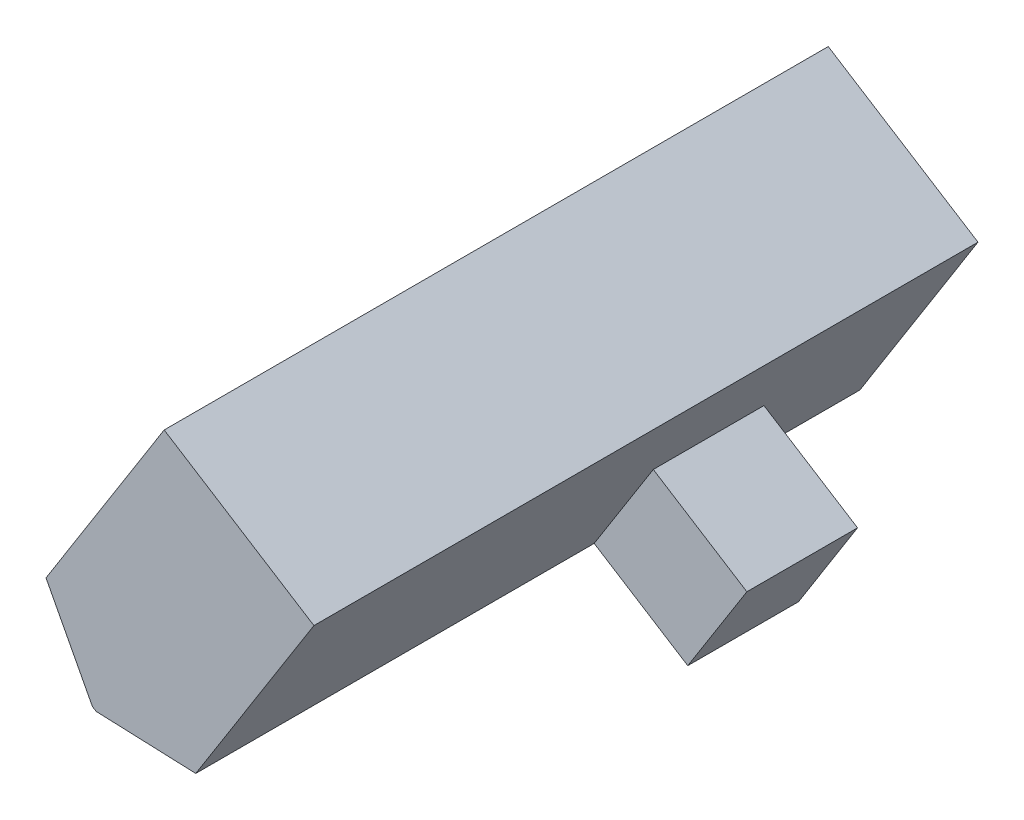
ISO-10303-21;
HEADER;
FILE_DESCRIPTION(('STEP AP214'),'2;1');
FILE_NAME('part.step','',(''),(''),'','','');
FILE_SCHEMA(('AUTOMOTIVE_DESIGN { 1 0 10303 214 1 1 1 1 }'));
ENDSEC;
DATA;
#1=APPLICATION_CONTEXT('core data for automotive mechanical design processes');
#2=APPLICATION_PROTOCOL_DEFINITION('international standard','automotive_design',2000,#1);
#3=PRODUCT_CONTEXT('',#1,'mechanical');
#4=PRODUCT('Part','Part','',(#3));
#5=PRODUCT_RELATED_PRODUCT_CATEGORY('part','',(#4));
#6=PRODUCT_DEFINITION_FORMATION('','',#4);
#7=PRODUCT_DEFINITION_CONTEXT('part definition',#1,'design');
#8=PRODUCT_DEFINITION('design','',#6,#7);
#9=PRODUCT_DEFINITION_SHAPE('','',#8);
#10=(LENGTH_UNIT() NAMED_UNIT(*) SI_UNIT(.MILLI.,.METRE.));
#11=(NAMED_UNIT(*) PLANE_ANGLE_UNIT() SI_UNIT($,.RADIAN.));
#12=(NAMED_UNIT(*) SI_UNIT($,.STERADIAN.) SOLID_ANGLE_UNIT());
#13=UNCERTAINTY_MEASURE_WITH_UNIT(LENGTH_MEASURE(1.E-05),#10,'distance_accuracy_value','');
#14=(GEOMETRIC_REPRESENTATION_CONTEXT(3) GLOBAL_UNCERTAINTY_ASSIGNED_CONTEXT((#13)) GLOBAL_UNIT_ASSIGNED_CONTEXT((#10,
#11,#12)) REPRESENTATION_CONTEXT('',''));
#15=CARTESIAN_POINT('',(0.,0.,0.));
#16=DIRECTION('',(0.,0.,1.));
#17=DIRECTION('',(1.,0.,0.));
#18=AXIS2_PLACEMENT_3D('',#15,#16,#17);
#19=CARTESIAN_POINT('',(24.1648696354659,27.969040400658,6.99999999999998));
#20=DIRECTION('',(0.533901931949956,0.845546407395894,0.));
#21=DIRECTION('',(-0.845546407395895,0.533901931949956,0.));
#22=AXIS2_PLACEMENT_3D('',#19,#20,#21);
#23=PLANE('',#22);
#24=DIRECTION('',(0.,0.,1.));
#25=VECTOR('',#24,1.);
#26=CARTESIAN_POINT('',(24.1648696354659,27.969040400658,6.99999999999998));
#27=LINE('',#26,#25);
#28=CARTESIAN_POINT('',(24.1648696354659,27.969040400658,6.99999999999998));
#29=VERTEX_POINT('',#28);
#30=CARTESIAN_POINT('',(24.1648696354659,27.969040400658,12.));
#31=VERTEX_POINT('',#30);
#32=EDGE_CURVE('E135',#29,#31,#27,.T.);
#33=ORIENTED_EDGE('',*,*,#32,.T.);
#34=DIRECTION('',(-0.845546407395894,0.533901931949956,0.));
#35=VECTOR('',#34,1.);
#36=CARTESIAN_POINT('',(28.3926016724454,25.2995307409082,12.));
#37=LINE('',#36,#35);
#38=CARTESIAN_POINT('',(28.3926016724454,25.2995307409082,12.));
#39=VERTEX_POINT('',#38);
#40=EDGE_CURVE('E129',#39,#31,#37,.T.);
#41=ORIENTED_EDGE('',*,*,#40,.F.);
#42=DIRECTION('',(0.,0.,1.));
#43=VECTOR('',#42,1.);
#44=CARTESIAN_POINT('',(28.3926016724454,25.2995307409082,6.99999999999998));
#45=LINE('',#44,#43);
#46=CARTESIAN_POINT('',(28.3926016724454,25.2995307409082,6.99999999999998));
#47=VERTEX_POINT('',#46);
#48=EDGE_CURVE('E128',#47,#39,#45,.T.);
#49=ORIENTED_EDGE('',*,*,#48,.F.);
#50=DIRECTION('',(-0.845546407395894,0.533901931949956,0.));
#51=VECTOR('',#50,1.);
#52=CARTESIAN_POINT('',(24.1648696354659,27.969040400658,6.99999999999998));
#53=LINE('',#52,#51);
#54=EDGE_CURVE('E133',#47,#29,#53,.T.);
#55=ORIENTED_EDGE('',*,*,#54,.T.);
#56=EDGE_LOOP('',(#33,#41,#49,#55));
#57=FACE_BOUND('',#56,.T.);
#58=ADVANCED_FACE('F39',(#57),#23,.T.);
#59=CARTESIAN_POINT('',(25.7230920126956,21.0717987039287,6.99999999999998));
#60=DIRECTION('',(0.845546407395894,-0.533901931949957,0.));
#61=DIRECTION('',(0.533901931949957,0.845546407395894,0.));
#62=AXIS2_PLACEMENT_3D('',#59,#60,#61);
#63=PLANE('',#62);
#64=ORIENTED_EDGE('',*,*,#48,.T.);
#65=DIRECTION('',(0.533901931949957,0.845546407395894,0.));
#66=VECTOR('',#65,1.);
#67=CARTESIAN_POINT('',(25.7230920126956,21.0717987039287,12.));
#68=LINE('',#67,#66);
#69=CARTESIAN_POINT('',(25.7230920126956,21.0717987039287,12.));
#70=VERTEX_POINT('',#69);
#71=EDGE_CURVE('E118',#70,#39,#68,.T.);
#72=ORIENTED_EDGE('',*,*,#71,.F.);
#73=DIRECTION('',(0.,0.,1.));
#74=VECTOR('',#73,1.);
#75=CARTESIAN_POINT('',(25.7230920126956,21.0717987039287,6.99999999999998));
#76=LINE('',#75,#74);
#77=CARTESIAN_POINT('',(25.7230920126956,21.0717987039287,6.99999999999998));
#78=VERTEX_POINT('',#77);
#79=EDGE_CURVE('E126',#78,#70,#76,.T.);
#80=ORIENTED_EDGE('',*,*,#79,.F.);
#81=DIRECTION('',(0.533901931949957,0.845546407395894,0.));
#82=VECTOR('',#81,1.);
#83=CARTESIAN_POINT('',(25.7230920126956,21.0717987039287,6.99999999999998));
#84=LINE('',#83,#82);
#85=EDGE_CURVE('E138',#78,#47,#84,.T.);
#86=ORIENTED_EDGE('',*,*,#85,.T.);
#87=EDGE_LOOP('',(#64,#72,#80,#86));
#88=FACE_BOUND('',#87,.T.);
#89=ADVANCED_FACE('F124',(#88),#63,.T.);
#90=CARTESIAN_POINT('',(25.7230920126956,21.0717987039287,6.99999999999998));
#91=DIRECTION('',(-0.533901931949956,-0.845546407395895,0.));
#92=DIRECTION('',(0.845546407395895,-0.533901931949956,0.));
#93=AXIS2_PLACEMENT_3D('',#90,#91,#92);
#94=PLANE('',#93);
#95=ORIENTED_EDGE('',*,*,#79,.T.);
#96=DIRECTION('',(0.845546407395895,-0.533901931949956,0.));
#97=VECTOR('',#96,1.);
#98=CARTESIAN_POINT('',(21.4953599757162,23.7413083636785,12.));
#99=LINE('',#98,#97);
#100=CARTESIAN_POINT('',(21.4953599757162,23.7413083636785,12.));
#101=VERTEX_POINT('',#100);
#102=EDGE_CURVE('E115',#101,#70,#99,.T.);
#103=ORIENTED_EDGE('',*,*,#102,.F.);
#104=DIRECTION('',(0.,0.,-1.));
#105=VECTOR('',#104,1.);
#106=CARTESIAN_POINT('',(21.4953599757162,23.7413083636785,30.));
#107=LINE('',#106,#105);
#108=CARTESIAN_POINT('',(21.4953599757162,23.7413083636785,6.99999999999998));
#109=VERTEX_POINT('',#108);
#110=EDGE_CURVE('E62',#101,#109,#107,.T.);
#111=ORIENTED_EDGE('',*,*,#110,.T.);
#112=DIRECTION('',(0.845546407395895,-0.533901931949956,0.));
#113=VECTOR('',#112,1.);
#114=CARTESIAN_POINT('',(25.7230920126956,21.0717987039287,6.99999999999998));
#115=LINE('',#114,#113);
#116=EDGE_CURVE('E132',#109,#78,#115,.T.);
#117=ORIENTED_EDGE('',*,*,#116,.T.);
#118=EDGE_LOOP('',(#95,#103,#111,#117));
#119=FACE_BOUND('',#118,.T.);
#120=ADVANCED_FACE('F131',(#119),#94,.T.);
#121=CARTESIAN_POINT('',(26.8343792952157,32.1967724376374,30.));
#122=DIRECTION('',(-0.845546407395894,0.533901931949957,0.));
#123=DIRECTION('',(-0.533901931949957,-0.845546407395894,0.));
#124=AXIS2_PLACEMENT_3D('',#121,#122,#123);
#125=PLANE('',#124);
#126=ORIENTED_EDGE('',*,*,#32,.F.);
#127=DIRECTION('',(-0.533901931949958,-0.845546407395894,0.));
#128=VECTOR('',#127,1.);
#129=CARTESIAN_POINT('',(21.4953599757162,23.7413083636785,6.99999999999998));
#130=LINE('',#129,#128);
#131=EDGE_CURVE('E191',#29,#109,#130,.T.);
#132=ORIENTED_EDGE('',*,*,#131,.T.);
#133=CARTESIAN_POINT('',(21.4953599757162,23.7413083636785,0.));
#134=VERTEX_POINT('',#133);
#135=EDGE_CURVE('E182',#109,#134,#107,.T.);
#136=ORIENTED_EDGE('',*,*,#135,.T.);
#137=DIRECTION('',(-0.533901931949957,-0.845546407395894,0.));
#138=VECTOR('',#137,1.);
#139=CARTESIAN_POINT('',(26.8343792952157,32.1967724376374,0.));
#140=LINE('',#139,#138);
#141=CARTESIAN_POINT('',(26.8343792952157,32.1967724376374,0.));
#142=VERTEX_POINT('',#141);
#143=EDGE_CURVE('E159',#142,#134,#140,.T.);
#144=ORIENTED_EDGE('',*,*,#143,.F.);
#145=DIRECTION('',(0.,0.,-1.));
#146=VECTOR('',#145,1.);
#147=CARTESIAN_POINT('',(26.8343792952157,32.1967724376374,30.));
#148=LINE('',#147,#146);
#149=CARTESIAN_POINT('',(26.8343792952157,32.1967724376374,30.));
#150=VERTEX_POINT('',#149);
#151=EDGE_CURVE('E142',#150,#142,#148,.T.);
#152=ORIENTED_EDGE('',*,*,#151,.F.);
#153=DIRECTION('',(-0.533901931949957,-0.845546407395894,0.));
#154=VECTOR('',#153,1.);
#155=CARTESIAN_POINT('',(26.8343792952157,32.1967724376374,30.));
#156=LINE('',#155,#154);
#157=CARTESIAN_POINT('',(21.4953599757162,23.7413083636785,30.));
#158=VERTEX_POINT('',#157);
#159=EDGE_CURVE('E151',#150,#158,#156,.T.);
#160=ORIENTED_EDGE('',*,*,#159,.T.);
#161=EDGE_CURVE('E47',#158,#101,#107,.T.);
#162=ORIENTED_EDGE('',*,*,#161,.T.);
#163=DIRECTION('',(-0.533901931949958,-0.845546407395894,0.));
#164=VECTOR('',#163,1.);
#165=CARTESIAN_POINT('',(21.4953599757162,23.7413083636785,12.));
#166=LINE('',#165,#164);
#167=EDGE_CURVE('E54',#31,#101,#166,.T.);
#168=ORIENTED_EDGE('',*,*,#167,.F.);
#169=EDGE_LOOP('',(#126,#132,#136,#144,#152,#160,#162,#168));
#170=FACE_BOUND('',#169,.T.);
#171=ADVANCED_FACE('F189',(#170),#125,.F.);
#172=CARTESIAN_POINT('',(16.8262645713054,24.0267724977935,30.));
#173=DIRECTION('',(0.533901931949966,0.845546407395888,0.));
#174=DIRECTION('',(-0.845546407395888,0.533901931949966,0.));
#175=AXIS2_PLACEMENT_3D('',#172,#173,#174);
#176=PLANE('',#175);
#177=DIRECTION('',(0.845546407395888,-0.533901931949966,0.));
#178=VECTOR('',#177,1.);
#179=CARTESIAN_POINT('',(16.8262645713054,24.0267724977935,0.));
#180=LINE('',#179,#178);
#181=CARTESIAN_POINT('',(16.8262645713054,24.0267724977935,0.));
#182=VERTEX_POINT('',#181);
#183=CARTESIAN_POINT('',(16.9959601507649,23.9196219062656,0.));
#184=VERTEX_POINT('',#183);
#185=EDGE_CURVE('E162',#182,#184,#180,.T.);
#186=ORIENTED_EDGE('',*,*,#185,.T.);
#187=DIRECTION('',(0.,0.,-1.));
#188=VECTOR('',#187,1.);
#189=CARTESIAN_POINT('',(16.9959601507649,23.9196219062656,30.));
#190=LINE('',#189,#188);
#191=CARTESIAN_POINT('',(16.9959601507649,23.9196219062656,30.));
#192=VERTEX_POINT('',#191);
#193=EDGE_CURVE('E11',#192,#184,#190,.T.);
#194=ORIENTED_EDGE('',*,*,#193,.F.);
#195=DIRECTION('',(0.845546407395888,-0.533901931949966,0.));
#196=VECTOR('',#195,1.);
#197=CARTESIAN_POINT('',(16.8262645713054,24.0267724977935,30.));
#198=LINE('',#197,#196);
#199=CARTESIAN_POINT('',(16.8262645713054,24.0267724977935,30.));
#200=VERTEX_POINT('',#199);
#201=EDGE_CURVE('E163',#200,#192,#198,.T.);
#202=ORIENTED_EDGE('',*,*,#201,.F.);
#203=DIRECTION('',(0.,0.,-1.));
#204=VECTOR('',#203,1.);
#205=CARTESIAN_POINT('',(16.8262645713054,24.0267724977935,30.));
#206=LINE('',#205,#204);
#207=EDGE_CURVE('E172',#200,#182,#206,.T.);
#208=ORIENTED_EDGE('',*,*,#207,.T.);
#209=EDGE_LOOP('',(#186,#194,#202,#208));
#210=FACE_BOUND('',#209,.T.);
#211=ADVANCED_FACE('F41',(#210),#176,.F.);
#212=CARTESIAN_POINT('',(16.9959601507649,23.9196219062656,30.));
#213=DIRECTION('',(0.039599432500308,0.999215634858489,0.));
#214=DIRECTION('',(-0.999215634858489,0.039599432500308,0.));
#215=AXIS2_PLACEMENT_3D('',#212,#213,#214);
#216=PLANE('',#215);
#217=DIRECTION('',(0.999215634858489,-0.039599432500308,0.));
#218=VECTOR('',#217,1.);
#219=CARTESIAN_POINT('',(16.9959601507649,23.9196219062656,0.));
#220=LINE('',#219,#218);
#221=EDGE_CURVE('E175',#184,#134,#220,.T.);
#222=ORIENTED_EDGE('',*,*,#221,.T.);
#223=ORIENTED_EDGE('',*,*,#135,.F.);
#224=ORIENTED_EDGE('',*,*,#110,.F.);
#225=ORIENTED_EDGE('',*,*,#161,.F.);
#226=DIRECTION('',(0.999215634858489,-0.039599432500308,0.));
#227=VECTOR('',#226,1.);
#228=CARTESIAN_POINT('',(16.9959601507649,23.9196219062656,30.));
#229=LINE('',#228,#227);
#230=EDGE_CURVE('E166',#192,#158,#229,.T.);
#231=ORIENTED_EDGE('',*,*,#230,.F.);
#232=ORIENTED_EDGE('',*,*,#193,.T.);
#233=EDGE_LOOP('',(#222,#223,#224,#225,#231,#232));
#234=FACE_BOUND('',#233,.T.);
#235=ADVANCED_FACE('F193',(#234),#216,.F.);
#236=CARTESIAN_POINT('',(16.8262645713054,24.0267724977935,30.));
#237=DIRECTION('',(0.8851458398962,0.465313702908534,0.));
#238=DIRECTION('',(-0.465313702908534,0.8851458398962,0.));
#239=AXIS2_PLACEMENT_3D('',#236,#237,#238);
#240=PLANE('',#239);
#241=DIRECTION('',(0.465313702908534,-0.8851458398962,0.));
#242=VECTOR('',#241,1.);
#243=CARTESIAN_POINT('',(16.8262645713054,24.0267724977935,0.));
#244=LINE('',#243,#242);
#245=CARTESIAN_POINT('',(14.730988716549,28.0125238192781,0.));
#246=VERTEX_POINT('',#245);
#247=EDGE_CURVE('E167',#246,#182,#244,.T.);
#248=ORIENTED_EDGE('',*,*,#247,.T.);
#249=ORIENTED_EDGE('',*,*,#207,.F.);
#250=DIRECTION('',(0.465313702908534,-0.8851458398962,0.));
#251=VECTOR('',#250,1.);
#252=CARTESIAN_POINT('',(16.8262645713054,24.0267724977935,30.));
#253=LINE('',#252,#251);
#254=CARTESIAN_POINT('',(14.730988716549,28.0125238192781,30.));
#255=VERTEX_POINT('',#254);
#256=EDGE_CURVE('E170',#255,#200,#253,.T.);
#257=ORIENTED_EDGE('',*,*,#256,.F.);
#258=DIRECTION('',(0.,0.,-1.));
#259=VECTOR('',#258,1.);
#260=CARTESIAN_POINT('',(14.730988716549,28.0125238192781,30.));
#261=LINE('',#260,#259);
#262=EDGE_CURVE('E181',#255,#246,#261,.T.);
#263=ORIENTED_EDGE('',*,*,#262,.T.);
#264=EDGE_LOOP('',(#248,#249,#257,#263));
#265=FACE_BOUND('',#264,.T.);
#266=ADVANCED_FACE('F215',(#265),#240,.F.);
#267=CARTESIAN_POINT('',(0.,0.,30.));
#268=DIRECTION('',(0.,0.,1.));
#269=DIRECTION('',(1.,0.,0.));
#270=AXIS2_PLACEMENT_3D('',#267,#268,#269);
#271=PLANE('',#270);
#272=ORIENTED_EDGE('',*,*,#230,.T.);
#273=ORIENTED_EDGE('',*,*,#159,.F.);
#274=DIRECTION('',(0.845546407395894,-0.533901931949957,0.));
#275=VECTOR('',#274,1.);
#276=CARTESIAN_POINT('',(26.8343792952157,32.1967724376374,30.));
#277=LINE('',#276,#275);
#278=CARTESIAN_POINT('',(20.0700080360486,36.4679878932371,30.));
#279=VERTEX_POINT('',#278);
#280=EDGE_CURVE('E149',#279,#150,#277,.T.);
#281=ORIENTED_EDGE('',*,*,#280,.F.);
#282=DIRECTION('',(-0.533901931949957,-0.845546407395894,0.));
#283=VECTOR('',#282,1.);
#284=CARTESIAN_POINT('',(20.0700080360486,36.4679878932371,30.));
#285=LINE('',#284,#283);
#286=EDGE_CURVE('E153',#279,#255,#285,.T.);
#287=ORIENTED_EDGE('',*,*,#286,.T.);
#288=ORIENTED_EDGE('',*,*,#256,.T.);
#289=ORIENTED_EDGE('',*,*,#201,.T.);
#290=EDGE_LOOP('',(#272,#273,#281,#287,#288,#289));
#291=FACE_BOUND('',#290,.T.);
#292=ADVANCED_FACE('F206',(#291),#271,.T.);
#293=CARTESIAN_POINT('',(0.,0.,0.));
#294=DIRECTION('',(0.,0.,1.));
#295=DIRECTION('',(1.,0.,0.));
#296=AXIS2_PLACEMENT_3D('',#293,#294,#295);
#297=PLANE('',#296);
#298=ORIENTED_EDGE('',*,*,#185,.F.);
#299=ORIENTED_EDGE('',*,*,#247,.F.);
#300=DIRECTION('',(-0.533901931949957,-0.845546407395894,0.));
#301=VECTOR('',#300,1.);
#302=CARTESIAN_POINT('',(20.0700080360486,36.4679878932371,0.));
#303=LINE('',#302,#301);
#304=CARTESIAN_POINT('',(20.0700080360486,36.4679878932371,0.));
#305=VERTEX_POINT('',#304);
#306=EDGE_CURVE('E156',#305,#246,#303,.T.);
#307=ORIENTED_EDGE('',*,*,#306,.F.);
#308=DIRECTION('',(-0.845546407395894,0.533901931949957,0.));
#309=VECTOR('',#308,1.);
#310=CARTESIAN_POINT('',(26.8343792952157,32.1967724376374,0.));
#311=LINE('',#310,#309);
#312=EDGE_CURVE('E145',#142,#305,#311,.T.);
#313=ORIENTED_EDGE('',*,*,#312,.F.);
#314=ORIENTED_EDGE('',*,*,#143,.T.);
#315=ORIENTED_EDGE('',*,*,#221,.F.);
#316=EDGE_LOOP('',(#298,#299,#307,#313,#314,#315));
#317=FACE_BOUND('',#316,.T.);
#318=ADVANCED_FACE('F197',(#317),#297,.F.);
#319=CARTESIAN_POINT('',(20.0700080360486,36.4679878932371,30.));
#320=DIRECTION('',(0.845546407395894,-0.533901931949957,0.));
#321=DIRECTION('',(0.533901931949957,0.845546407395894,0.));
#322=AXIS2_PLACEMENT_3D('',#319,#320,#321);
#323=PLANE('',#322);
#324=ORIENTED_EDGE('',*,*,#262,.F.);
#325=ORIENTED_EDGE('',*,*,#286,.F.);
#326=DIRECTION('',(0.,0.,1.));
#327=VECTOR('',#326,1.);
#328=CARTESIAN_POINT('',(20.0700080360486,36.4679878932371,30.));
#329=LINE('',#328,#327);
#330=EDGE_CURVE('E147',#305,#279,#329,.T.);
#331=ORIENTED_EDGE('',*,*,#330,.F.);
#332=ORIENTED_EDGE('',*,*,#306,.T.);
#333=EDGE_LOOP('',(#324,#325,#331,#332));
#334=FACE_BOUND('',#333,.T.);
#335=ADVANCED_FACE('F213',(#334),#323,.F.);
#336=CARTESIAN_POINT('',(22.1840482364551,35.1331230799703,0.));
#337=DIRECTION('',(0.533901931949957,0.845546407395894,0.));
#338=DIRECTION('',(-0.845546407395894,0.533901931949957,0.));
#339=AXIS2_PLACEMENT_3D('',#336,#337,#338);
#340=PLANE('',#339);
#341=ORIENTED_EDGE('',*,*,#151,.T.);
#342=ORIENTED_EDGE('',*,*,#312,.T.);
#343=ORIENTED_EDGE('',*,*,#330,.T.);
#344=ORIENTED_EDGE('',*,*,#280,.T.);
#345=EDGE_LOOP('',(#341,#342,#343,#344));
#346=FACE_BOUND('',#345,.T.);
#347=ADVANCED_FACE('F202',(#346),#340,.T.);
#348=CARTESIAN_POINT('',(0.,0.,6.99999999999998));
#349=DIRECTION('',(0.,0.,-1.));
#350=DIRECTION('',(-1.,0.,0.));
#351=AXIS2_PLACEMENT_3D('',#348,#349,#350);
#352=PLANE('',#351);
#353=ORIENTED_EDGE('',*,*,#131,.F.);
#354=ORIENTED_EDGE('',*,*,#54,.F.);
#355=ORIENTED_EDGE('',*,*,#85,.F.);
#356=ORIENTED_EDGE('',*,*,#116,.F.);
#357=EDGE_LOOP('',(#353,#354,#355,#356));
#358=FACE_BOUND('',#357,.T.);
#359=ADVANCED_FACE('F235',(#358),#352,.T.);
#360=CARTESIAN_POINT('',(0.,0.,12.));
#361=DIRECTION('',(0.,0.,1.));
#362=DIRECTION('',(1.,0.,0.));
#363=AXIS2_PLACEMENT_3D('',#360,#361,#362);
#364=PLANE('',#363);
#365=ORIENTED_EDGE('',*,*,#102,.T.);
#366=ORIENTED_EDGE('',*,*,#71,.T.);
#367=ORIENTED_EDGE('',*,*,#40,.T.);
#368=ORIENTED_EDGE('',*,*,#167,.T.);
#369=EDGE_LOOP('',(#365,#366,#367,#368));
#370=FACE_BOUND('',#369,.T.);
#371=ADVANCED_FACE('F117',(#370),#364,.T.);
#372=CLOSED_SHELL('',(#58,#89,#120,#171,#211,#235,#266,#292,#318,#335,#347,#359,#371));
#373=MANIFOLD_SOLID_BREP('B2',#372);
#374=ADVANCED_BREP_SHAPE_REPRESENTATION('',(#18,#373),#14);
#375=SHAPE_DEFINITION_REPRESENTATION(#9,#374);
ENDSEC;
END-ISO-10303-21;
